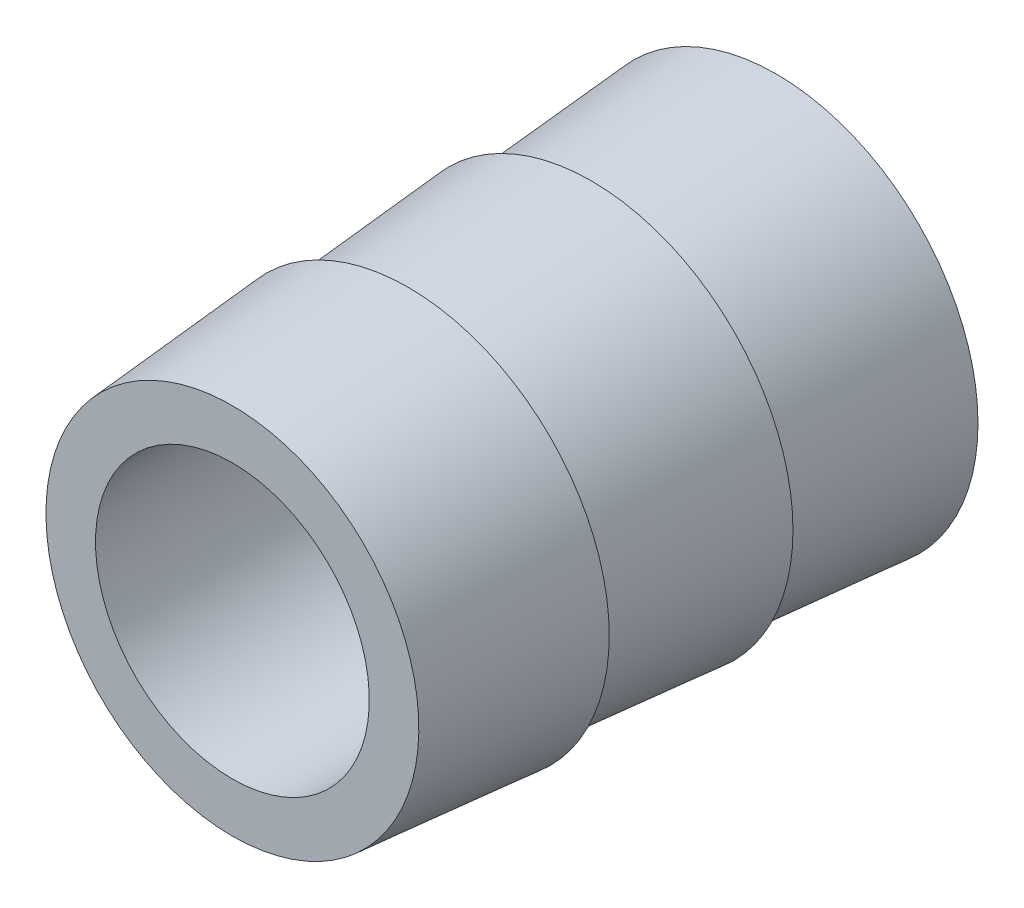
ISO-10303-21;
HEADER;
FILE_DESCRIPTION(('STEP AP214'),'2;1');
FILE_NAME('part.step','',(''),(''),'','','');
FILE_SCHEMA(('AUTOMOTIVE_DESIGN { 1 0 10303 214 1 1 1 1 }'));
ENDSEC;
DATA;
#1=APPLICATION_CONTEXT('core data for automotive mechanical design processes');
#2=APPLICATION_PROTOCOL_DEFINITION('international standard','automotive_design',2000,#1);
#3=PRODUCT_CONTEXT('',#1,'mechanical');
#4=PRODUCT('Part','Part','',(#3));
#5=PRODUCT_RELATED_PRODUCT_CATEGORY('part','',(#4));
#6=PRODUCT_DEFINITION_FORMATION('','',#4);
#7=PRODUCT_DEFINITION_CONTEXT('part definition',#1,'design');
#8=PRODUCT_DEFINITION('design','',#6,#7);
#9=PRODUCT_DEFINITION_SHAPE('','',#8);
#10=(LENGTH_UNIT() NAMED_UNIT(*) SI_UNIT(.MILLI.,.METRE.));
#11=(NAMED_UNIT(*) PLANE_ANGLE_UNIT() SI_UNIT($,.RADIAN.));
#12=(NAMED_UNIT(*) SI_UNIT($,.STERADIAN.) SOLID_ANGLE_UNIT());
#13=UNCERTAINTY_MEASURE_WITH_UNIT(LENGTH_MEASURE(1.E-05),#10,'distance_accuracy_value','');
#14=(GEOMETRIC_REPRESENTATION_CONTEXT(3) GLOBAL_UNCERTAINTY_ASSIGNED_CONTEXT((#13)) GLOBAL_UNIT_ASSIGNED_CONTEXT((#10,
#11,#12)) REPRESENTATION_CONTEXT('',''));
#15=CARTESIAN_POINT('',(0.,0.,0.));
#16=DIRECTION('',(0.,0.,1.));
#17=DIRECTION('',(1.,0.,0.));
#18=AXIS2_PLACEMENT_3D('',#15,#16,#17);
#19=CARTESIAN_POINT('',(0.,-1.26984070723933,-6.851295576114));
#20=DIRECTION('',(0.,0.,-1.));
#21=DIRECTION('',(0.,1.,0.));
#22=AXIS2_PLACEMENT_3D('',#19,#20,#21);
#23=CONICAL_SURFACE('',#22,4.0516120872864,0.0792126806704468);
#24=CARTESIAN_POINT('',(0.,-1.26984070723933,-3.13711020299854));
#25=DIRECTION('',(0.,0.,1.));
#26=DIRECTION('',(0.,-1.,0.));
#27=AXIS2_PLACEMENT_3D('',#24,#25,#26);
#28=CIRCLE('',#27,3.75678460296661);
#29=CARTESIAN_POINT('',(0.,-5.02662531020594,-3.13711020299854));
#30=VERTEX_POINT('',#29);
#31=EDGE_CURVE('E10',#30,#30,#28,.T.);
#32=ORIENTED_EDGE('',*,*,#31,.F.);
#33=EDGE_LOOP('',(#32));
#34=FACE_BOUND('',#33,.T.);
#35=CARTESIAN_POINT('',(0.,-1.26984070723933,-6.851295576114));
#36=DIRECTION('',(0.,0.,1.));
#37=DIRECTION('',(0.,-1.,0.));
#38=AXIS2_PLACEMENT_3D('',#35,#36,#37);
#39=CIRCLE('',#38,4.0516120872864);
#40=CARTESIAN_POINT('',(0.,-5.32145279452572,-6.851295576114));
#41=VERTEX_POINT('',#40);
#42=EDGE_CURVE('E74',#41,#41,#39,.T.);
#43=ORIENTED_EDGE('',*,*,#42,.T.);
#44=EDGE_LOOP('',(#43));
#45=FACE_BOUND('',#44,.T.);
#46=ADVANCED_FACE('F47',(#34,#45),#23,.T.);
#47=CARTESIAN_POINT('',(0.,0.,-3.13711020299854));
#48=DIRECTION('',(0.,0.,1.));
#49=DIRECTION('',(0.,-1.,0.));
#50=AXIS2_PLACEMENT_3D('',#47,#48,#49);
#51=PLANE('',#50);
#52=CARTESIAN_POINT('',(0.,-1.26984070723933,-3.13711020299854));
#53=DIRECTION('',(0.,0.,1.));
#54=DIRECTION('',(0.,-1.,0.));
#55=AXIS2_PLACEMENT_3D('',#52,#53,#54);
#56=CIRCLE('',#55,4.04888460296661);
#57=CARTESIAN_POINT('',(0.,-5.31872531020594,-3.13711020299854));
#58=VERTEX_POINT('',#57);
#59=EDGE_CURVE('E54',#58,#58,#56,.T.);
#60=ORIENTED_EDGE('',*,*,#59,.F.);
#61=EDGE_LOOP('',(#60));
#62=FACE_BOUND('',#61,.T.);
#63=ORIENTED_EDGE('',*,*,#31,.T.);
#64=EDGE_LOOP('',(#63));
#65=FACE_BOUND('',#64,.T.);
#66=ADVANCED_FACE('F103',(#62,#65),#51,.F.);
#67=CARTESIAN_POINT('',(0.,-1.26984070723933,-3.13711020299854));
#68=DIRECTION('',(0.,0.,-1.));
#69=DIRECTION('',(0.,1.,0.));
#70=AXIS2_PLACEMENT_3D('',#67,#68,#69);
#71=CONICAL_SURFACE('',#70,4.04888460296661,0.0824552885010236);
#72=CARTESIAN_POINT('',(0.,-1.26984070723933,0.541748287160756));
#73=DIRECTION('',(0.,0.,1.));
#74=DIRECTION('',(0.,-1.,0.));
#75=AXIS2_PLACEMENT_3D('',#72,#73,#74);
#76=CIRCLE('',#75,3.74485393015888);
#77=CARTESIAN_POINT('',(0.,-5.01469463739821,0.541748287160756));
#78=VERTEX_POINT('',#77);
#79=EDGE_CURVE('E59',#78,#78,#76,.T.);
#80=ORIENTED_EDGE('',*,*,#79,.F.);
#81=EDGE_LOOP('',(#80));
#82=FACE_BOUND('',#81,.T.);
#83=ORIENTED_EDGE('',*,*,#59,.T.);
#84=EDGE_LOOP('',(#83));
#85=FACE_BOUND('',#84,.T.);
#86=ADVANCED_FACE('F108',(#82,#85),#71,.T.);
#87=CARTESIAN_POINT('',(0.,0.,0.541748287160756));
#88=DIRECTION('',(0.,0.,1.));
#89=DIRECTION('',(0.,-1.,0.));
#90=AXIS2_PLACEMENT_3D('',#87,#88,#89);
#91=PLANE('',#90);
#92=CARTESIAN_POINT('',(0.,-1.26984070723933,0.541748287160756));
#93=DIRECTION('',(0.,0.,1.));
#94=DIRECTION('',(0.,-1.,0.));
#95=AXIS2_PLACEMENT_3D('',#92,#93,#94);
#96=CIRCLE('',#95,4.03695393015889);
#97=CARTESIAN_POINT('',(0.,-5.30679463739822,0.541748287160756));
#98=VERTEX_POINT('',#97);
#99=EDGE_CURVE('E64',#98,#98,#96,.T.);
#100=ORIENTED_EDGE('',*,*,#99,.F.);
#101=EDGE_LOOP('',(#100));
#102=FACE_BOUND('',#101,.T.);
#103=ORIENTED_EDGE('',*,*,#79,.T.);
#104=EDGE_LOOP('',(#103));
#105=FACE_BOUND('',#104,.T.);
#106=ADVANCED_FACE('F113',(#102,#105),#91,.F.);
#107=CARTESIAN_POINT('',(0.,-1.26984070723933,0.541748287160756));
#108=DIRECTION('',(0.,0.,-1.));
#109=DIRECTION('',(0.,1.,0.));
#110=AXIS2_PLACEMENT_3D('',#107,#108,#109);
#111=CONICAL_SURFACE('',#110,4.03695393015889,0.0824552885010241);
#112=CARTESIAN_POINT('',(0.,-1.26984070723933,4.07486097142274));
#113=DIRECTION('',(0.,0.,1.));
#114=DIRECTION('',(0.,-1.,0.));
#115=AXIS2_PLACEMENT_3D('',#112,#113,#114);
#116=CIRCLE('',#115,3.74496807928285);
#117=CARTESIAN_POINT('',(0.,-5.01480878652218,4.07486097142274));
#118=VERTEX_POINT('',#117);
#119=EDGE_CURVE('E70',#118,#118,#116,.T.);
#120=ORIENTED_EDGE('',*,*,#119,.F.);
#121=EDGE_LOOP('',(#120));
#122=FACE_BOUND('',#121,.T.);
#123=ORIENTED_EDGE('',*,*,#99,.T.);
#124=EDGE_LOOP('',(#123));
#125=FACE_BOUND('',#124,.T.);
#126=ADVANCED_FACE('F119',(#122,#125),#111,.T.);
#127=CARTESIAN_POINT('',(0.,0.,4.07486097142274));
#128=DIRECTION('',(0.,0.,1.));
#129=DIRECTION('',(0.,-1.,0.));
#130=AXIS2_PLACEMENT_3D('',#127,#128,#129);
#131=PLANE('',#130);
#132=CARTESIAN_POINT('',(0.,-1.26984070723933,4.07486097142274));
#133=DIRECTION('',(0.,0.,-1.));
#134=DIRECTION('',(0.,1.,0.));
#135=AXIS2_PLACEMENT_3D('',#132,#133,#134);
#136=CIRCLE('',#135,2.75);
#137=CARTESIAN_POINT('',(0.,1.48015929276067,4.07486097142274));
#138=VERTEX_POINT('',#137);
#139=EDGE_CURVE('E78',#138,#138,#136,.T.);
#140=ORIENTED_EDGE('',*,*,#139,.T.);
#141=EDGE_LOOP('',(#140));
#142=FACE_BOUND('',#141,.T.);
#143=ORIENTED_EDGE('',*,*,#119,.T.);
#144=EDGE_LOOP('',(#143));
#145=FACE_BOUND('',#144,.T.);
#146=ADVANCED_FACE('F87',(#142,#145),#131,.T.);
#147=CARTESIAN_POINT('',(0.,0.,-6.851295576114));
#148=DIRECTION('',(0.,0.,-1.));
#149=DIRECTION('',(0.,1.,0.));
#150=AXIS2_PLACEMENT_3D('',#147,#148,#149);
#151=PLANE('',#150);
#152=CARTESIAN_POINT('',(0.,-1.26984070723933,-6.851295576114));
#153=DIRECTION('',(0.,0.,-1.));
#154=DIRECTION('',(0.,1.,0.));
#155=AXIS2_PLACEMENT_3D('',#152,#153,#154);
#156=CIRCLE('',#155,2.75);
#157=CARTESIAN_POINT('',(0.,1.48015929276067,-6.851295576114));
#158=VERTEX_POINT('',#157);
#159=EDGE_CURVE('E79',#158,#158,#156,.T.);
#160=ORIENTED_EDGE('',*,*,#159,.F.);
#161=EDGE_LOOP('',(#160));
#162=FACE_BOUND('',#161,.T.);
#163=ORIENTED_EDGE('',*,*,#42,.F.);
#164=EDGE_LOOP('',(#163));
#165=FACE_BOUND('',#164,.T.);
#166=ADVANCED_FACE('F93',(#162,#165),#151,.T.);
#167=CARTESIAN_POINT('',(0.,-1.26984070723933,4.07486097142274));
#168=DIRECTION('',(0.,0.,-1.));
#169=DIRECTION('',(0.,1.,0.));
#170=AXIS2_PLACEMENT_3D('',#167,#168,#169);
#171=CYLINDRICAL_SURFACE('',#170,2.75);
#172=ORIENTED_EDGE('',*,*,#139,.F.);
#173=EDGE_LOOP('',(#172));
#174=FACE_BOUND('',#173,.T.);
#175=ORIENTED_EDGE('',*,*,#159,.T.);
#176=EDGE_LOOP('',(#175));
#177=FACE_BOUND('',#176,.T.);
#178=ADVANCED_FACE('F90',(#174,#177),#171,.F.);
#179=CLOSED_SHELL('',(#46,#66,#86,#106,#126,#146,#166,#178));
#180=MANIFOLD_SOLID_BREP('B2',#179);
#181=ADVANCED_BREP_SHAPE_REPRESENTATION('',(#18,#180),#14);
#182=SHAPE_DEFINITION_REPRESENTATION(#9,#181);
ENDSEC;
END-ISO-10303-21;
